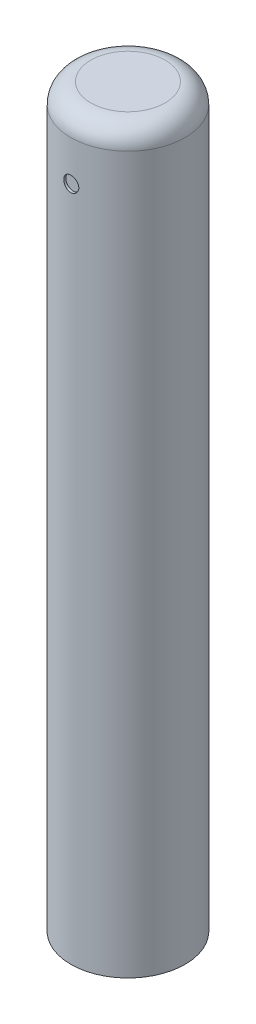
ISO-10303-21;
HEADER;
FILE_DESCRIPTION(('STEP AP214'),'2;1');
FILE_NAME('part.step','',(''),(''),'','','');
FILE_SCHEMA(('AUTOMOTIVE_DESIGN { 1 0 10303 214 1 1 1 1 }'));
ENDSEC;
DATA;
#1=APPLICATION_CONTEXT('core data for automotive mechanical design processes');
#2=APPLICATION_PROTOCOL_DEFINITION('international standard','automotive_design',2000,#1);
#3=PRODUCT_CONTEXT('',#1,'mechanical');
#4=PRODUCT('Part','Part','',(#3));
#5=PRODUCT_RELATED_PRODUCT_CATEGORY('part','',(#4));
#6=PRODUCT_DEFINITION_FORMATION('','',#4);
#7=PRODUCT_DEFINITION_CONTEXT('part definition',#1,'design');
#8=PRODUCT_DEFINITION('design','',#6,#7);
#9=PRODUCT_DEFINITION_SHAPE('','',#8);
#10=(LENGTH_UNIT() NAMED_UNIT(*) SI_UNIT(.MILLI.,.METRE.));
#11=(NAMED_UNIT(*) PLANE_ANGLE_UNIT() SI_UNIT($,.RADIAN.));
#12=(NAMED_UNIT(*) SI_UNIT($,.STERADIAN.) SOLID_ANGLE_UNIT());
#13=UNCERTAINTY_MEASURE_WITH_UNIT(LENGTH_MEASURE(1.E-05),#10,'distance_accuracy_value','');
#14=(GEOMETRIC_REPRESENTATION_CONTEXT(3) GLOBAL_UNCERTAINTY_ASSIGNED_CONTEXT((#13)) GLOBAL_UNIT_ASSIGNED_CONTEXT((#10,
#11,#12)) REPRESENTATION_CONTEXT('',''));
#15=CARTESIAN_POINT('',(0.,0.,0.));
#16=DIRECTION('',(0.,0.,1.));
#17=DIRECTION('',(1.,0.,0.));
#18=AXIS2_PLACEMENT_3D('',#15,#16,#17);
#19=CARTESIAN_POINT('',(0.,186.69,0.));
#20=DIRECTION('',(0.,-1.,0.));
#21=DIRECTION('',(0.,0.,-1.));
#22=AXIS2_PLACEMENT_3D('',#19,#20,#21);
#23=CYLINDRICAL_SURFACE('',#22,14.5);
#24=CARTESIAN_POINT('',(1.905,171.45,14.3743165054899));
#25=CARTESIAN_POINT('',(1.90499549999393,171.343491909056,14.3743181028585));
#26=CARTESIAN_POINT('',(1.89603758125483,171.236918375917,14.3755130695719));
#27=CARTESIAN_POINT('',(1.86044615302821,171.026740528796,14.3801616754458));
#28=CARTESIAN_POINT('',(1.83379446618679,170.923139382742,14.3836176373433));
#29=CARTESIAN_POINT('',(1.76361760450347,170.72197958524,14.3923901886962));
#30=CARTESIAN_POINT('',(1.72010423773381,170.62441676054,14.3977054758313));
#31=CARTESIAN_POINT('',(1.61746512196847,170.437994937187,14.4095962161836));
#32=CARTESIAN_POINT('',(1.55834191751715,170.349134523196,14.416171463968));
#33=CARTESIAN_POINT('',(1.42577105365582,170.18207462265,14.4298866682678));
#34=CARTESIAN_POINT('',(1.35224623494449,170.103936598213,14.4370295376587));
#35=CARTESIAN_POINT('',(1.19312550344266,169.961070859736,14.4510490194296));
#36=CARTESIAN_POINT('',(1.10752897587284,169.896343829096,14.4579256182264));
#37=CARTESIAN_POINT('',(0.926306317327277,169.781915314415,14.4706677457286));
#38=CARTESIAN_POINT('',(0.830644612187151,169.732269711425,14.4765294803979));
#39=CARTESIAN_POINT('',(0.632251548373415,169.649771388372,14.4865493412109));
#40=CARTESIAN_POINT('',(0.529520478617748,169.616917982489,14.4907075369283));
#41=CARTESIAN_POINT('',(0.320534710597358,169.569120983575,14.4968312789755));
#42=CARTESIAN_POINT('',(0.214303805076185,169.554074991396,14.4988093572099));
#43=CARTESIAN_POINT('',(0.000807754287172511,169.542002425649,14.50039282177));
#44=CARTESIAN_POINT('',(-0.106457346081825,169.544975073301,14.499998310641));
#45=CARTESIAN_POINT('',(-0.318279772878875,169.568773640541,14.4968911561325));
#46=CARTESIAN_POINT('',(-0.422849712602923,169.5894894241,14.4941928135303));
#47=CARTESIAN_POINT('',(-0.627015980768544,169.648013882944,14.4867971976393));
#48=CARTESIAN_POINT('',(-0.726612206344917,169.685822911585,14.4820998830274));
#49=CARTESIAN_POINT('',(-0.91834302173835,169.777576675407,14.4712094690808));
#50=CARTESIAN_POINT('',(-1.01045469217536,169.831568762578,14.4650119906156));
#51=CARTESIAN_POINT('',(-1.18435169133744,169.954121532365,14.4518139926139));
#52=CARTESIAN_POINT('',(-1.26613649682591,170.022682952702,14.4448134324215));
#53=CARTESIAN_POINT('',(-1.4177057731361,170.17304426072,14.4307296999455));
#54=CARTESIAN_POINT('',(-1.48739499401019,170.254940177272,14.4236463029647));
#55=CARTESIAN_POINT('',(-1.61205376396632,170.429316742703,14.410247249697));
#56=CARTESIAN_POINT('',(-1.6670232577583,170.521797431339,14.4039315962939));
#57=CARTESIAN_POINT('',(-1.76068939194048,170.714806646716,14.3927832511147));
#58=CARTESIAN_POINT('',(-1.79937788939856,170.815339170729,14.3879513017381));
#59=CARTESIAN_POINT('',(-1.85929664996117,171.021551890736,14.3803315916679));
#60=CARTESIAN_POINT('',(-1.88052784589797,171.127231811359,14.3775437217497));
#61=CARTESIAN_POINT('',(-1.90480211909016,171.339896740952,14.3743479903928));
#62=CARTESIAN_POINT('',(-1.90797947444601,171.446866168765,14.3739225585129));
#63=CARTESIAN_POINT('',(-1.89641064777414,171.659811836776,14.3754533620609));
#64=CARTESIAN_POINT('',(-1.88166488887648,171.765788100361,14.3774095412637));
#65=CARTESIAN_POINT('',(-1.83478167129997,171.973333534344,14.3834670974347));
#66=CARTESIAN_POINT('',(-1.80270967901348,172.074917749338,14.3875603974471));
#67=CARTESIAN_POINT('',(-1.72215195849238,172.271267037101,14.3974244114785));
#68=CARTESIAN_POINT('',(-1.67366559680186,172.366031846528,14.4031951902327));
#69=CARTESIAN_POINT('',(-1.5613271390533,172.546658487469,14.4158058675239));
#70=CARTESIAN_POINT('',(-1.49738725629373,172.632465293417,14.4226517929002));
#71=CARTESIAN_POINT('',(-1.3560803775402,172.79217774328,14.4366226690221));
#72=CARTESIAN_POINT('',(-1.27871280336658,172.866082874459,14.4437476317725));
#73=CARTESIAN_POINT('',(-1.11215899375032,173.0003682868,14.4575279829203));
#74=CARTESIAN_POINT('',(-1.02290116444766,173.060660152075,14.4641801195272));
#75=CARTESIAN_POINT('',(-0.835447173151515,173.165394786765,14.4762162402395));
#76=CARTESIAN_POINT('',(-0.737251207318721,173.209837903899,14.4816002521664));
#77=CARTESIAN_POINT('',(-0.53499791335765,173.281468582312,14.4904791056405));
#78=CARTESIAN_POINT('',(-0.430958700663531,173.308706581199,14.4939794646946));
#79=CARTESIAN_POINT('',(-0.219734367138322,173.345317730342,14.4987195909781));
#80=CARTESIAN_POINT('',(-0.112549404060706,173.354691774893,14.49995947137));
#81=CARTESIAN_POINT('',(0.101061935329718,173.355290991172,14.5000382641936));
#82=CARTESIAN_POINT('',(0.207487948785617,173.346652240422,14.4988951787359));
#83=CARTESIAN_POINT('',(0.417361248137909,173.311760121348,14.4943723756736));
#84=CARTESIAN_POINT('',(0.52080853768115,173.285506774592,14.4909926608075));
#85=CARTESIAN_POINT('',(0.721765355335967,173.21617479403,14.4823745945624));
#86=CARTESIAN_POINT('',(0.819277411456709,173.173103382378,14.4771370410803));
#87=CARTESIAN_POINT('',(1.00571137168386,173.071372053538,14.4653821296222));
#88=CARTESIAN_POINT('',(1.09463313061899,173.012711872972,14.4588647500236));
#89=CARTESIAN_POINT('',(1.26205648384932,172.880967243384,14.4452182591185));
#90=CARTESIAN_POINT('',(1.34047819033591,172.807781687115,14.4380850700151));
#91=CARTESIAN_POINT('',(1.48397951753903,172.649274952154,14.4240430335043));
#92=CARTESIAN_POINT('',(1.54905598250082,172.56395091113,14.4171342394839));
#93=CARTESIAN_POINT('',(1.6642603681873,172.383168594354,14.4042917867171));
#94=CARTESIAN_POINT('',(1.71432334311315,172.287668644209,14.3983624130288));
#95=CARTESIAN_POINT('',(1.797628573501,172.089590227827,14.3882003167272));
#96=CARTESIAN_POINT('',(1.83088892490853,171.987019512532,14.3839657698595));
#97=CARTESIAN_POINT('',(1.87177978299688,171.811611505882,14.3786892035807));
#98=CARTESIAN_POINT('',(1.88421918206081,171.739875582369,14.3770577318199));
#99=CARTESIAN_POINT('',(1.90083079096445,171.595436606415,14.3748708420589));
#100=CARTESIAN_POINT('',(1.9050030730198,171.522733562429,14.3743154146591));
#101=CARTESIAN_POINT('',(1.905,171.45,14.3743165054899));
#102=B_SPLINE_CURVE_WITH_KNOTS('',3,(#24,#25,#26,#27,#28,#29,#30,#31,#32,#33,#34,#35,#36,#37,
#38,#39,#40,#41,#42,#43,#44,#45,#46,#47,#48,#49,#50,#51,#52,#53,#54,#55,#56,#57,#58,#59,#60,#61,
#62,#63,#64,#65,#66,#67,#68,#69,#70,#71,#72,#73,#74,#75,#76,#77,#78,#79,#80,#81,#82,#83,#84,#85,
#86,#87,#88,#89,#90,#91,#92,#93,#94,#95,#96,#97,#98,#99,#100,#101),.UNSPECIFIED.,.T.,.F.,(4,2,2,
2,2,2,2,2,2,2,2,2,2,2,2,2,2,2,2,2,2,2,2,2,2,2,2,2,2,2,2,2,2,2,2,2,2,2,4),(0.,0.319258532915203,
0.638845558560639,0.958209183764502,1.27752078192385,1.59859240681923,1.91968038892815,
2.24194397760132,2.56419440349332,2.88458262617756,3.2049570015096,3.52335702764984,
3.84176363614051,4.16111115869035,4.48047485529886,4.80224939751156,5.12402514835286,
5.44596164444902,5.76788093672491,6.08740274083014,6.40691700179003,6.72523235120307,
7.04355998629869,7.36374029848838,7.68393440066533,8.00615183915239,8.3283622078031,
8.6496235635404,8.97086883606004,9.28969605886705,9.60852289131778,9.92721296079084,
10.245908415008,10.5669053642366,10.8879781324381,11.2104204106513,11.5325146834582,
11.7505358034705,11.9685550189978),.UNSPECIFIED.);
#103=CARTESIAN_POINT('',(1.905,171.45,14.3743165054899));
#104=VERTEX_POINT('',#103);
#105=EDGE_CURVE('E10',#104,#104,#102,.T.);
#106=ORIENTED_EDGE('',*,*,#105,.T.);
#107=EDGE_LOOP('',(#106));
#108=FACE_BOUND('',#107,.T.);
#109=CARTESIAN_POINT('',(0.,181.61,0.));
#110=DIRECTION('',(0.,1.,0.));
#111=DIRECTION('',(0.,0.,1.));
#112=AXIS2_PLACEMENT_3D('',#109,#110,#111);
#113=CIRCLE('',#112,14.5);
#114=CARTESIAN_POINT('',(0.,181.61,14.5));
#115=VERTEX_POINT('',#114);
#116=EDGE_CURVE('E54',#115,#115,#113,.F.);
#117=ORIENTED_EDGE('',*,*,#116,.T.);
#118=EDGE_LOOP('',(#117));
#119=FACE_BOUND('',#118,.T.);
#120=CARTESIAN_POINT('',(0.,0.,0.));
#121=DIRECTION('',(0.,1.,0.));
#122=DIRECTION('',(0.,0.,1.));
#123=AXIS2_PLACEMENT_3D('',#120,#121,#122);
#124=CIRCLE('',#123,14.5);
#125=CARTESIAN_POINT('',(0.,0.,14.5));
#126=VERTEX_POINT('',#125);
#127=EDGE_CURVE('E94',#126,#126,#124,.T.);
#128=ORIENTED_EDGE('',*,*,#127,.T.);
#129=EDGE_LOOP('',(#128));
#130=FACE_BOUND('',#129,.T.);
#131=CARTESIAN_POINT('',(0.,173.355,-14.5));
#132=CARTESIAN_POINT('',(0.106512563215627,173.354995503903,-14.4999984532778));
#133=CARTESIAN_POINT('',(0.213090555759518,173.346036858259,-14.4988140147637));
#134=CARTESIAN_POINT('',(0.423277667225632,173.310442280531,-14.4942029987715));
#135=CARTESIAN_POINT('',(0.526883621746625,173.283788186942,-14.4907741177883));
#136=CARTESIAN_POINT('',(0.728053590686023,173.213604285889,-14.4820602722797));
#137=CARTESIAN_POINT('',(0.825621737649047,173.170086172438,-14.4767765941641));
#138=CARTESIAN_POINT('',(1.01205249286941,173.067435875723,-14.4649398963735));
#139=CARTESIAN_POINT('',(1.10091652297332,173.008306248505,-14.4583870845382));
#140=CARTESIAN_POINT('',(1.26797239815626,172.875728872369,-14.4446986609271));
#141=CARTESIAN_POINT('',(1.34610391283667,172.802205401261,-14.4375600883003));
#142=CARTESIAN_POINT('',(1.48895707077777,172.643090105995,-14.423528408689));
#143=CARTESIAN_POINT('',(1.55367801064974,172.557497649211,-14.4166353145957));
#144=CARTESIAN_POINT('',(1.66810011020148,172.376278614847,-14.4038460463982));
#145=CARTESIAN_POINT('',(1.71774428283536,172.28061576277,-14.3979536909558));
#146=CARTESIAN_POINT('',(1.80023964588079,172.082220208007,-14.3878724929774));
#147=CARTESIAN_POINT('',(1.83309153862663,171.979487801207,-14.3836835791967));
#148=CARTESIAN_POINT('',(1.8808854435415,171.770497705324,-14.3775120657254));
#149=CARTESIAN_POINT('',(1.8959296995647,171.664263776729,-14.3755168753618));
#150=CARTESIAN_POINT('',(1.90799774532226,171.450761789473,-14.3739202672989));
#151=CARTESIAN_POINT('',(1.90502233314649,171.343493776822,-14.3743187435842));
#152=CARTESIAN_POINT('',(1.88121934262262,171.131683417235,-14.3774529241628));
#153=CARTESIAN_POINT('',(1.86050468490687,171.027128130464,-14.3801738443885));
#154=CARTESIAN_POINT('',(1.80198753879576,170.822990585127,-14.3876232685102));
#155=CARTESIAN_POINT('',(1.76418467117879,170.723408436978,-14.3923518169594));
#156=CARTESIAN_POINT('',(1.67244375849926,170.531694866107,-14.4033003720487));
#157=CARTESIAN_POINT('',(1.61845693965702,170.43958705046,-14.4095248756621));
#158=CARTESIAN_POINT('',(1.49591546493852,170.265695535927,-14.4227605788941));
#159=CARTESIAN_POINT('',(1.427360073435,170.183912358708,-14.4297718182297));
#160=CARTESIAN_POINT('',(1.27700310022391,170.032336446556,-14.4438566331801));
#161=CARTESIAN_POINT('',(1.19510424426215,169.962640173567,-14.4509302755255));
#162=CARTESIAN_POINT('',(1.02071926447937,169.837968567152,-14.4642928116775));
#163=CARTESIAN_POINT('',(0.928233111688356,169.782993274009,-14.4705817033368));
#164=CARTESIAN_POINT('',(0.735222295307692,169.689322943892,-14.4816706460338));
#165=CARTESIAN_POINT('',(0.634694502957953,169.65063428058,-14.486470114003));
#166=CARTESIAN_POINT('',(0.428492085638392,169.590713743901,-14.4940342687774));
#167=CARTESIAN_POINT('',(0.322817727314607,169.569480967153,-14.4967990608809));
#168=CARTESIAN_POINT('',(0.110155574974782,169.545200718665,-14.499968599723));
#169=CARTESIAN_POINT('',(0.00318319196664829,169.542020430038,-14.5003905826173));
#170=CARTESIAN_POINT('',(-0.209769086546579,169.553584444823,-14.4988735850852));
#171=CARTESIAN_POINT('',(-0.315749005395502,169.568328325567,-14.4969346603312));
#172=CARTESIAN_POINT('',(-0.523313593333489,169.61521178637,-14.4909244197477));
#173=CARTESIAN_POINT('',(-0.624912886432672,169.647287708247,-14.4868609089858));
#174=CARTESIAN_POINT('',(-0.821290596597295,169.727858325168,-14.4770562205848));
#175=CARTESIAN_POINT('',(-0.916068760062559,169.776353630281,-14.4713149806103));
#176=CARTESIAN_POINT('',(-1.09670480811161,169.888705423491,-14.4587514374476));
#177=CARTESIAN_POINT('',(-1.18250908095234,169.952647430788,-14.4519231905525));
#178=CARTESIAN_POINT('',(-1.3422154334272,170.093957025903,-14.4379671888356));
#179=CARTESIAN_POINT('',(-1.4161169888274,170.171325204741,-14.4308394208394));
#180=CARTESIAN_POINT('',(-1.55039423296386,170.337877519814,-14.417034183886));
#181=CARTESIAN_POINT('',(-1.61068163777393,170.427133129169,-14.410359839863));
#182=CARTESIAN_POINT('',(-1.71540845282413,170.614581448927,-14.3982695048539));
#183=CARTESIAN_POINT('',(-1.75984820838977,170.712773964533,-14.3928534864495));
#184=CARTESIAN_POINT('',(-1.8314767564918,170.915029079821,-14.3839146600056));
#185=CARTESIAN_POINT('',(-1.85871453072548,171.019074085071,-14.3803864808699));
#186=CARTESIAN_POINT('',(-1.89532326935655,171.230310670956,-14.3756076806894));
#187=CARTESIAN_POINT('',(-1.90469515938617,171.337502088284,-14.3743569416504));
#188=CARTESIAN_POINT('',(-1.90528790905991,171.551110071368,-14.3742783135093));
#189=CARTESIAN_POINT('',(-1.89664748607068,171.657526271854,-14.3754319080134));
#190=CARTESIAN_POINT('',(-1.86175546655504,171.867379517602,-14.3799920545261));
#191=CARTESIAN_POINT('',(-1.83550387450949,171.970816563623,-14.3833986059616));
#192=CARTESIAN_POINT('',(-1.76617946627872,172.171752192673,-14.3920749282992));
#193=CARTESIAN_POINT('',(-1.72311406033104,172.269253369927,-14.3973438783026));
#194=CARTESIAN_POINT('',(-1.62139812448193,172.455668065553,-14.4091525810316));
#195=CARTESIAN_POINT('',(-1.56274731890856,172.544581431987,-14.4156923562348));
#196=CARTESIAN_POINT('',(-1.43101321676593,172.712004757946,-14.4293661098383));
#197=CARTESIAN_POINT('',(-1.35782665502484,172.790433142817,-14.4365041153572));
#198=CARTESIAN_POINT('',(-1.19931513204785,172.933947476151,-14.4505349484625));
#199=CARTESIAN_POINT('',(-1.11398732398272,172.999030286637,-14.4574277180719));
#200=CARTESIAN_POINT('',(-0.933201726539282,173.114241756522,-14.4702237089028));
#201=CARTESIAN_POINT('',(-0.837702947722651,173.164306544897,-14.4761226581406));
#202=CARTESIAN_POINT('',(-0.639626968823701,173.247615486867,-14.4862235245679));
#203=CARTESIAN_POINT('',(-0.537057510333087,173.280877715102,-14.4904272643205));
#204=CARTESIAN_POINT('',(-0.361644520881207,173.321773680879,-14.4956634136655));
#205=CARTESIAN_POINT('',(-0.289901999856455,173.334215377608,-14.4972816098294));
#206=CARTESIAN_POINT('',(-0.145449818901992,173.350830037431,-14.4994504266276));
#207=CARTESIAN_POINT('',(-0.0727401671619525,173.3550030705,-14.5000010562964));
#208=CARTESIAN_POINT('',(0.,173.355,-14.5));
#209=B_SPLINE_CURVE_WITH_KNOTS('',3,(#131,#132,#133,#134,#135,#136,#137,#138,#139,#140,#141,
#142,#143,#144,#145,#146,#147,#148,#149,#150,#151,#152,#153,#154,#155,#156,#157,#158,#159,#160,
#161,#162,#163,#164,#165,#166,#167,#168,#169,#170,#171,#172,#173,#174,#175,#176,#177,#178,#179,
#180,#181,#182,#183,#184,#185,#186,#187,#188,#189,#190,#191,#192,#193,#194,#195,#196,#197,#198,
#199,#200,#201,#202,#203,#204,#205,#206,#207,#208),.UNSPECIFIED.,.T.,.F.,(4,2,2,2,2,2,2,2,2,2,2,
2,2,2,2,2,2,2,2,2,2,2,2,2,2,2,2,2,2,2,2,2,2,2,2,2,2,2,4),(0.,0.319271968825646,
0.638872126123881,0.958251058603112,1.27757773215242,1.59863177076505,1.9197026444991,
2.24197241341014,2.56422870233931,2.88462561700303,3.20500834141311,3.52336667507618,
3.8417320740952,4.16106674910132,4.48041755246378,4.80221015716026,5.12400364239834,
5.44592294249638,5.76782558150856,6.08735679791848,6.40688047963615,6.72523849400921,
7.04360833838558,7.36378291766526,7.68397159460829,8.00618051230736,8.32838240853876,
8.64966266626276,8.97092627799059,9.28972490039592,9.60852344168838,9.92718163938892,
10.2458454738373,10.5668598205817,10.8879495618597,11.2103861302476,11.5324751086515,
11.7505159877567,11.9685550216638),.UNSPECIFIED.);
#210=CARTESIAN_POINT('',(0.,173.355,-14.5));
#211=VERTEX_POINT('',#210);
#212=EDGE_CURVE('E49',#211,#211,#209,.T.);
#213=ORIENTED_EDGE('',*,*,#212,.F.);
#214=EDGE_LOOP('',(#213));
#215=FACE_BOUND('',#214,.T.);
#216=ADVANCED_FACE('F37',(#108,#119,#130,#215),#23,.T.);
#217=CARTESIAN_POINT('',(0.,186.69,0.));
#218=DIRECTION('',(0.,1.,0.));
#219=DIRECTION('',(0.,0.,1.));
#220=AXIS2_PLACEMENT_3D('',#217,#218,#219);
#221=PLANE('',#220);
#222=CARTESIAN_POINT('',(0.,186.69,0.));
#223=DIRECTION('',(0.,1.,0.));
#224=DIRECTION('',(0.,0.,1.));
#225=AXIS2_PLACEMENT_3D('',#222,#223,#224);
#226=CIRCLE('',#225,9.42);
#227=CARTESIAN_POINT('',(0.,186.69,9.42));
#228=VERTEX_POINT('',#227);
#229=EDGE_CURVE('E59',#228,#228,#226,.T.);
#230=ORIENTED_EDGE('',*,*,#229,.T.);
#231=EDGE_LOOP('',(#230));
#232=FACE_BOUND('',#231,.T.);
#233=ADVANCED_FACE('F75',(#232),#221,.T.);
#234=CARTESIAN_POINT('',(0.,0.,0.));
#235=DIRECTION('',(0.,1.,0.));
#236=DIRECTION('',(0.,0.,1.));
#237=AXIS2_PLACEMENT_3D('',#234,#235,#236);
#238=PLANE('',#237);
#239=ORIENTED_EDGE('',*,*,#127,.F.);
#240=EDGE_LOOP('',(#239));
#241=FACE_BOUND('',#240,.T.);
#242=ADVANCED_FACE('F77',(#241),#238,.F.);
#243=CARTESIAN_POINT('',(0.,181.61,0.));
#244=DIRECTION('',(0.,1.,0.));
#245=DIRECTION('',(0.,0.,1.));
#246=AXIS2_PLACEMENT_3D('',#243,#244,#245);
#247=TOROIDAL_SURFACE('',#246,9.42,5.08);
#248=ORIENTED_EDGE('',*,*,#116,.F.);
#249=EDGE_LOOP('',(#248));
#250=FACE_BOUND('',#249,.T.);
#251=ORIENTED_EDGE('',*,*,#229,.F.);
#252=EDGE_LOOP('',(#251));
#253=FACE_BOUND('',#252,.T.);
#254=ADVANCED_FACE('F39',(#250,#253),#247,.T.);
#255=CARTESIAN_POINT('',(0.,171.45,-13.864999956));
#256=DIRECTION('',(0.,0.,-1.));
#257=DIRECTION('',(-1.,0.,0.));
#258=AXIS2_PLACEMENT_3D('',#255,#256,#257);
#259=CYLINDRICAL_SURFACE('',#258,1.905);
#260=CARTESIAN_POINT('',(0.,171.45,-13.864999956));
#261=DIRECTION('',(0.,0.,1.));
#262=DIRECTION('',(1.,0.,0.));
#263=AXIS2_PLACEMENT_3D('',#260,#261,#262);
#264=CIRCLE('',#263,1.905);
#265=CARTESIAN_POINT('',(1.905,171.45,-13.864999956));
#266=VERTEX_POINT('',#265);
#267=EDGE_CURVE('E96',#266,#266,#264,.T.);
#268=ORIENTED_EDGE('',*,*,#267,.T.);
#269=EDGE_LOOP('',(#268));
#270=FACE_BOUND('',#269,.T.);
#271=ORIENTED_EDGE('',*,*,#212,.T.);
#272=EDGE_LOOP('',(#271));
#273=FACE_BOUND('',#272,.T.);
#274=ADVANCED_FACE('F68',(#270,#273),#259,.F.);
#275=CARTESIAN_POINT('',(0.,171.45,-13.864999956));
#276=DIRECTION('',(0.,0.,1.));
#277=DIRECTION('',(1.,0.,0.));
#278=AXIS2_PLACEMENT_3D('',#275,#276,#277);
#279=PLANE('',#278);
#280=ORIENTED_EDGE('',*,*,#267,.F.);
#281=EDGE_LOOP('',(#280));
#282=FACE_BOUND('',#281,.T.);
#283=ADVANCED_FACE('F73',(#282),#279,.F.);
#284=CARTESIAN_POINT('',(0.,171.45,13.864999956));
#285=DIRECTION('',(0.,0.,1.));
#286=DIRECTION('',(1.,0.,0.));
#287=AXIS2_PLACEMENT_3D('',#284,#285,#286);
#288=CYLINDRICAL_SURFACE('',#287,1.905);
#289=CARTESIAN_POINT('',(0.,171.45,13.864999956));
#290=DIRECTION('',(0.,0.,1.));
#291=DIRECTION('',(1.,0.,0.));
#292=AXIS2_PLACEMENT_3D('',#289,#290,#291);
#293=CIRCLE('',#292,1.905);
#294=CARTESIAN_POINT('',(1.905,171.45,13.864999956));
#295=VERTEX_POINT('',#294);
#296=EDGE_CURVE('E102',#295,#295,#293,.T.);
#297=ORIENTED_EDGE('',*,*,#296,.F.);
#298=EDGE_LOOP('',(#297));
#299=FACE_BOUND('',#298,.T.);
#300=ORIENTED_EDGE('',*,*,#105,.F.);
#301=EDGE_LOOP('',(#300));
#302=FACE_BOUND('',#301,.T.);
#303=ADVANCED_FACE('F111',(#299,#302),#288,.F.);
#304=CARTESIAN_POINT('',(0.,171.45,13.864999956));
#305=DIRECTION('',(0.,0.,1.));
#306=DIRECTION('',(1.,0.,0.));
#307=AXIS2_PLACEMENT_3D('',#304,#305,#306);
#308=PLANE('',#307);
#309=ORIENTED_EDGE('',*,*,#296,.T.);
#310=EDGE_LOOP('',(#309));
#311=FACE_BOUND('',#310,.T.);
#312=ADVANCED_FACE('F109',(#311),#308,.T.);
#313=CLOSED_SHELL('',(#216,#233,#242,#254,#274,#283,#303,#312));
#314=MANIFOLD_SOLID_BREP('B2',#313);
#315=ADVANCED_BREP_SHAPE_REPRESENTATION('',(#18,#314),#14);
#316=SHAPE_DEFINITION_REPRESENTATION(#9,#315);
ENDSEC;
END-ISO-10303-21;
